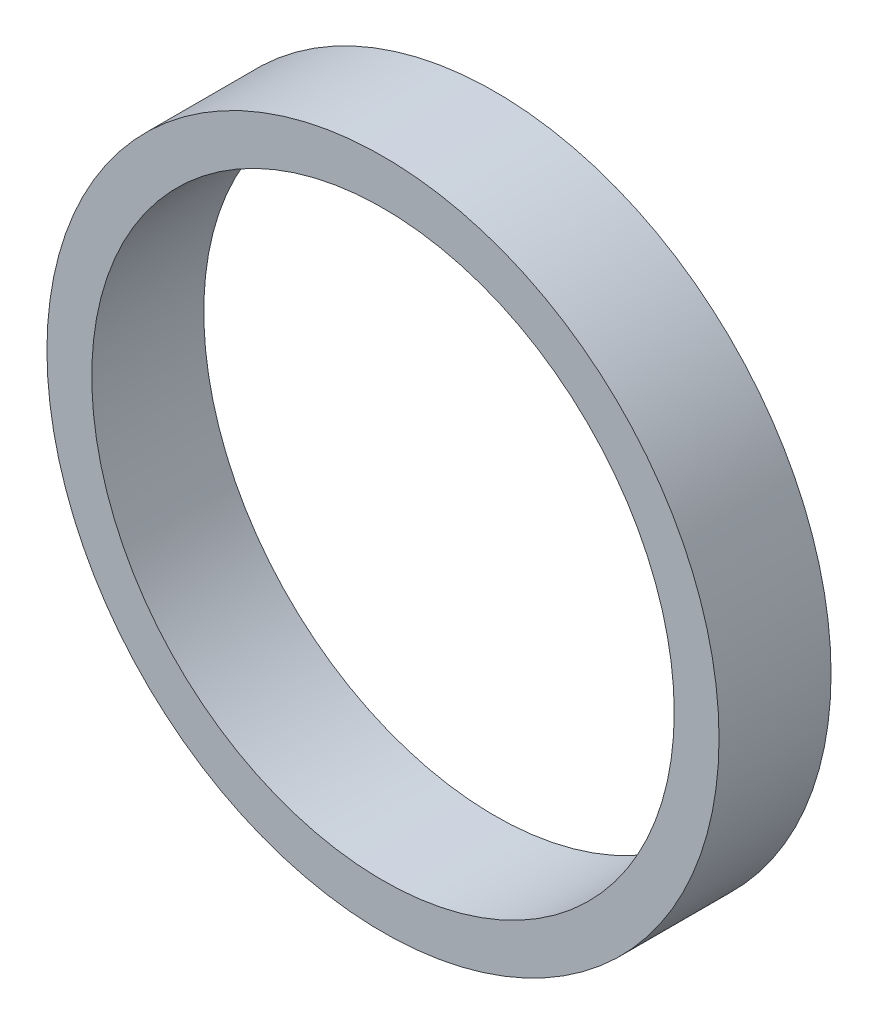
ISO-10303-21;
HEADER;
FILE_DESCRIPTION(('STEP AP214'),'2;1');
FILE_NAME('part.step','',(''),(''),'','','');
FILE_SCHEMA(('AUTOMOTIVE_DESIGN { 1 0 10303 214 1 1 1 1 }'));
ENDSEC;
DATA;
#1=APPLICATION_CONTEXT('core data for automotive mechanical design processes');
#2=APPLICATION_PROTOCOL_DEFINITION('international standard','automotive_design',2000,#1);
#3=PRODUCT_CONTEXT('',#1,'mechanical');
#4=PRODUCT('Part','Part','',(#3));
#5=PRODUCT_RELATED_PRODUCT_CATEGORY('part','',(#4));
#6=PRODUCT_DEFINITION_FORMATION('','',#4);
#7=PRODUCT_DEFINITION_CONTEXT('part definition',#1,'design');
#8=PRODUCT_DEFINITION('design','',#6,#7);
#9=PRODUCT_DEFINITION_SHAPE('','',#8);
#10=(LENGTH_UNIT() NAMED_UNIT(*) SI_UNIT(.MILLI.,.METRE.));
#11=(NAMED_UNIT(*) PLANE_ANGLE_UNIT() SI_UNIT($,.RADIAN.));
#12=(NAMED_UNIT(*) SI_UNIT($,.STERADIAN.) SOLID_ANGLE_UNIT());
#13=UNCERTAINTY_MEASURE_WITH_UNIT(LENGTH_MEASURE(1.E-05),#10,'distance_accuracy_value','');
#14=(GEOMETRIC_REPRESENTATION_CONTEXT(3) GLOBAL_UNCERTAINTY_ASSIGNED_CONTEXT((#13)) GLOBAL_UNIT_ASSIGNED_CONTEXT((#10,
#11,#12)) REPRESENTATION_CONTEXT('',''));
#15=CARTESIAN_POINT('',(0.,0.,0.));
#16=DIRECTION('',(0.,0.,1.));
#17=DIRECTION('',(1.,0.,0.));
#18=AXIS2_PLACEMENT_3D('',#15,#16,#17);
#19=CARTESIAN_POINT('',(0.,0.,0.5));
#20=DIRECTION('',(0.,0.,1.));
#21=DIRECTION('',(1.,0.,0.));
#22=AXIS2_PLACEMENT_3D('',#19,#20,#21);
#23=PLANE('',#22);
#24=CARTESIAN_POINT('',(0.,0.,0.5));
#25=DIRECTION('',(0.,0.,1.));
#26=DIRECTION('',(1.,0.,0.));
#27=AXIS2_PLACEMENT_3D('',#24,#25,#26);
#28=CIRCLE('',#27,1.5);
#29=CARTESIAN_POINT('',(1.5,0.,0.5));
#30=VERTEX_POINT('',#29);
#31=EDGE_CURVE('E10',#30,#30,#28,.T.);
#32=ORIENTED_EDGE('',*,*,#31,.T.);
#33=EDGE_LOOP('',(#32));
#34=FACE_BOUND('',#33,.T.);
#35=CARTESIAN_POINT('',(0.,0.,0.5));
#36=DIRECTION('',(0.,0.,1.));
#37=DIRECTION('',(1.,0.,0.));
#38=AXIS2_PLACEMENT_3D('',#35,#36,#37);
#39=CIRCLE('',#38,1.3);
#40=CARTESIAN_POINT('',(1.3,0.,0.5));
#41=VERTEX_POINT('',#40);
#42=EDGE_CURVE('E43',#41,#41,#39,.T.);
#43=ORIENTED_EDGE('',*,*,#42,.F.);
#44=EDGE_LOOP('',(#43));
#45=FACE_BOUND('',#44,.T.);
#46=ADVANCED_FACE('F32',(#34,#45),#23,.T.);
#47=CARTESIAN_POINT('',(0.,0.,0.));
#48=DIRECTION('',(0.,0.,1.));
#49=DIRECTION('',(1.,0.,0.));
#50=AXIS2_PLACEMENT_3D('',#47,#48,#49);
#51=PLANE('',#50);
#52=CARTESIAN_POINT('',(0.,0.,0.));
#53=DIRECTION('',(0.,0.,1.));
#54=DIRECTION('',(1.,0.,0.));
#55=AXIS2_PLACEMENT_3D('',#52,#53,#54);
#56=CIRCLE('',#55,1.5);
#57=CARTESIAN_POINT('',(1.5,0.,0.));
#58=VERTEX_POINT('',#57);
#59=EDGE_CURVE('E36',#58,#58,#56,.T.);
#60=ORIENTED_EDGE('',*,*,#59,.F.);
#61=EDGE_LOOP('',(#60));
#62=FACE_BOUND('',#61,.T.);
#63=CARTESIAN_POINT('',(0.,0.,0.));
#64=DIRECTION('',(0.,0.,1.));
#65=DIRECTION('',(1.,0.,0.));
#66=AXIS2_PLACEMENT_3D('',#63,#64,#65);
#67=CIRCLE('',#66,1.3);
#68=CARTESIAN_POINT('',(1.3,0.,0.));
#69=VERTEX_POINT('',#68);
#70=EDGE_CURVE('E45',#69,#69,#67,.T.);
#71=ORIENTED_EDGE('',*,*,#70,.T.);
#72=EDGE_LOOP('',(#71));
#73=FACE_BOUND('',#72,.T.);
#74=ADVANCED_FACE('F55',(#62,#73),#51,.F.);
#75=CARTESIAN_POINT('',(0.,0.,0.5));
#76=DIRECTION('',(0.,0.,-1.));
#77=DIRECTION('',(-1.,0.,0.));
#78=AXIS2_PLACEMENT_3D('',#75,#76,#77);
#79=CYLINDRICAL_SURFACE('',#78,1.5);
#80=ORIENTED_EDGE('',*,*,#31,.F.);
#81=EDGE_LOOP('',(#80));
#82=FACE_BOUND('',#81,.T.);
#83=ORIENTED_EDGE('',*,*,#59,.T.);
#84=EDGE_LOOP('',(#83));
#85=FACE_BOUND('',#84,.T.);
#86=ADVANCED_FACE('F34',(#82,#85),#79,.T.);
#87=CARTESIAN_POINT('',(0.,0.,0.5));
#88=DIRECTION('',(0.,0.,-1.));
#89=DIRECTION('',(-1.,0.,0.));
#90=AXIS2_PLACEMENT_3D('',#87,#88,#89);
#91=CYLINDRICAL_SURFACE('',#90,1.3);
#92=ORIENTED_EDGE('',*,*,#42,.T.);
#93=EDGE_LOOP('',(#92));
#94=FACE_BOUND('',#93,.T.);
#95=ORIENTED_EDGE('',*,*,#70,.F.);
#96=EDGE_LOOP('',(#95));
#97=FACE_BOUND('',#96,.T.);
#98=ADVANCED_FACE('F51',(#94,#97),#91,.F.);
#99=CLOSED_SHELL('',(#46,#74,#86,#98));
#100=MANIFOLD_SOLID_BREP('B2',#99);
#101=ADVANCED_BREP_SHAPE_REPRESENTATION('',(#18,#100),#14);
#102=SHAPE_DEFINITION_REPRESENTATION(#9,#101);
ENDSEC;
END-ISO-10303-21;
